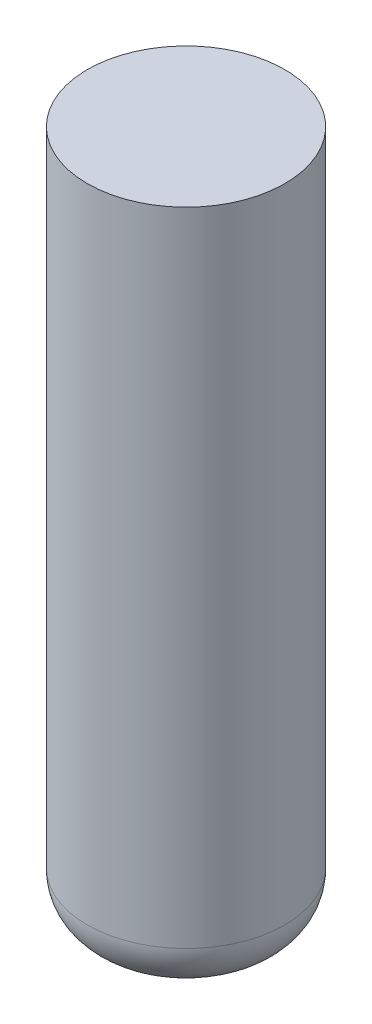
ISO-10303-21;
HEADER;
FILE_DESCRIPTION(('STEP AP214'),'2;1');
FILE_NAME('part.step','',(''),(''),'','','');
FILE_SCHEMA(('AUTOMOTIVE_DESIGN { 1 0 10303 214 1 1 1 1 }'));
ENDSEC;
DATA;
#1=APPLICATION_CONTEXT('core data for automotive mechanical design processes');
#2=APPLICATION_PROTOCOL_DEFINITION('international standard','automotive_design',2000,#1);
#3=PRODUCT_CONTEXT('',#1,'mechanical');
#4=PRODUCT('Part','Part','',(#3));
#5=PRODUCT_RELATED_PRODUCT_CATEGORY('part','',(#4));
#6=PRODUCT_DEFINITION_FORMATION('','',#4);
#7=PRODUCT_DEFINITION_CONTEXT('part definition',#1,'design');
#8=PRODUCT_DEFINITION('design','',#6,#7);
#9=PRODUCT_DEFINITION_SHAPE('','',#8);
#10=(LENGTH_UNIT() NAMED_UNIT(*) SI_UNIT(.MILLI.,.METRE.));
#11=(NAMED_UNIT(*) PLANE_ANGLE_UNIT() SI_UNIT($,.RADIAN.));
#12=(NAMED_UNIT(*) SI_UNIT($,.STERADIAN.) SOLID_ANGLE_UNIT());
#13=UNCERTAINTY_MEASURE_WITH_UNIT(LENGTH_MEASURE(1.E-05),#10,'distance_accuracy_value','');
#14=(GEOMETRIC_REPRESENTATION_CONTEXT(3) GLOBAL_UNCERTAINTY_ASSIGNED_CONTEXT((#13)) GLOBAL_UNIT_ASSIGNED_CONTEXT((#10,
#11,#12)) REPRESENTATION_CONTEXT('',''));
#15=CARTESIAN_POINT('',(0.,0.,0.));
#16=DIRECTION('',(0.,0.,1.));
#17=DIRECTION('',(1.,0.,0.));
#18=AXIS2_PLACEMENT_3D('',#15,#16,#17);
#19=CARTESIAN_POINT('',(0.,7.,0.));
#20=DIRECTION('',(0.,-1.,0.));
#21=DIRECTION('',(0.,0.,-1.));
#22=AXIS2_PLACEMENT_3D('',#19,#20,#21);
#23=CYLINDRICAL_SURFACE('',#22,1.);
#24=CARTESIAN_POINT('',(0.,0.5,0.));
#25=DIRECTION('',(0.,1.,0.));
#26=DIRECTION('',(0.,0.,1.));
#27=AXIS2_PLACEMENT_3D('',#24,#25,#26);
#28=CIRCLE('',#27,1.);
#29=CARTESIAN_POINT('',(0.,0.5,1.));
#30=VERTEX_POINT('',#29);
#31=EDGE_CURVE('E57',#30,#30,#28,.T.);
#32=ORIENTED_EDGE('',*,*,#31,.T.);
#33=EDGE_LOOP('',(#32));
#34=FACE_BOUND('',#33,.T.);
#35=CARTESIAN_POINT('',(0.,7.,0.));
#36=DIRECTION('',(0.,1.,0.));
#37=DIRECTION('',(0.,0.,1.));
#38=AXIS2_PLACEMENT_3D('',#35,#36,#37);
#39=CIRCLE('',#38,1.);
#40=CARTESIAN_POINT('',(0.,7.,1.));
#41=VERTEX_POINT('',#40);
#42=EDGE_CURVE('E62',#41,#41,#39,.T.);
#43=ORIENTED_EDGE('',*,*,#42,.F.);
#44=EDGE_LOOP('',(#43));
#45=FACE_BOUND('',#44,.T.);
#46=ADVANCED_FACE('F49',(#34,#45),#23,.T.);
#47=CARTESIAN_POINT('',(0.,7.,0.));
#48=DIRECTION('',(0.,1.,0.));
#49=DIRECTION('',(0.,0.,1.));
#50=AXIS2_PLACEMENT_3D('',#47,#48,#49);
#51=PLANE('',#50);
#52=ORIENTED_EDGE('',*,*,#42,.T.);
#53=EDGE_LOOP('',(#52));
#54=FACE_BOUND('',#53,.T.);
#55=ADVANCED_FACE('F70',(#54),#51,.T.);
#56=CARTESIAN_POINT('',(0.,0.,0.));
#57=DIRECTION('',(0.,1.,0.));
#58=DIRECTION('',(0.,0.,1.));
#59=AXIS2_PLACEMENT_3D('',#56,#57,#58);
#60=PLANE('',#59);
#61=CARTESIAN_POINT('',(0.,0.,0.));
#62=DIRECTION('',(0.,1.,0.));
#63=DIRECTION('',(0.,0.,1.));
#64=AXIS2_PLACEMENT_3D('',#61,#62,#63);
#65=CIRCLE('',#64,0.5);
#66=CARTESIAN_POINT('',(0.,0.,0.5));
#67=VERTEX_POINT('',#66);
#68=EDGE_CURVE('E10',#67,#67,#65,.F.);
#69=ORIENTED_EDGE('',*,*,#68,.T.);
#70=EDGE_LOOP('',(#69));
#71=FACE_BOUND('',#70,.T.);
#72=ADVANCED_FACE('F76',(#71),#60,.F.);
#73=CARTESIAN_POINT('',(0.,0.5,0.));
#74=DIRECTION('',(0.,1.,0.));
#75=DIRECTION('',(0.,0.,1.));
#76=AXIS2_PLACEMENT_3D('',#73,#74,#75);
#77=DEGENERATE_TOROIDAL_SURFACE('',#76,0.5,0.5,.T.);
#78=ORIENTED_EDGE('',*,*,#68,.F.);
#79=EDGE_LOOP('',(#78));
#80=FACE_BOUND('',#79,.T.);
#81=ORIENTED_EDGE('',*,*,#31,.F.);
#82=EDGE_LOOP('',(#81));
#83=FACE_BOUND('',#82,.T.);
#84=ADVANCED_FACE('F51',(#80,#83),#77,.T.);
#85=CLOSED_SHELL('',(#46,#55,#72,#84));
#86=MANIFOLD_SOLID_BREP('B2',#85);
#87=ADVANCED_BREP_SHAPE_REPRESENTATION('',(#18,#86),#14);
#88=SHAPE_DEFINITION_REPRESENTATION(#9,#87);
ENDSEC;
END-ISO-10303-21;
